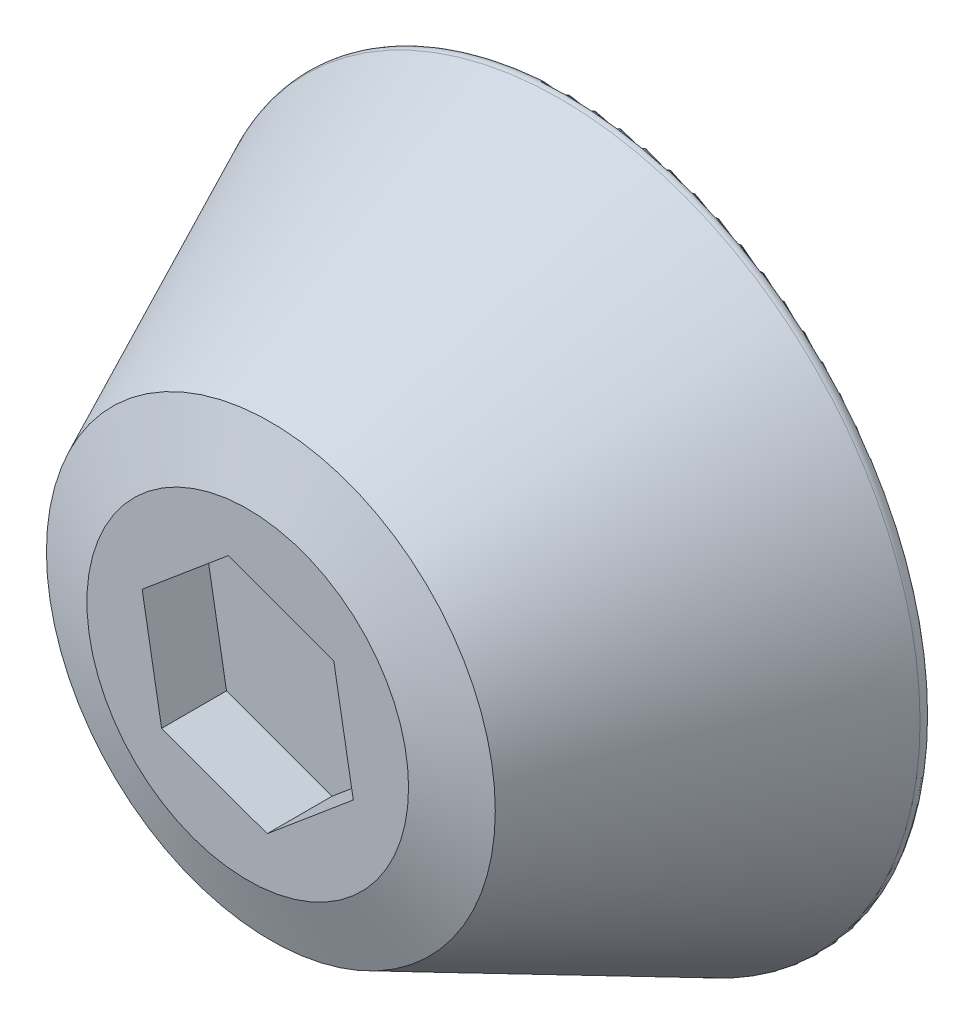
ISO-10303-21;
HEADER;
FILE_DESCRIPTION(('STEP AP214'),'2;1');
FILE_NAME('part.step','',(''),(''),'','','');
FILE_SCHEMA(('AUTOMOTIVE_DESIGN { 1 0 10303 214 1 1 1 1 }'));
ENDSEC;
DATA;
#1=APPLICATION_CONTEXT('core data for automotive mechanical design processes');
#2=APPLICATION_PROTOCOL_DEFINITION('international standard','automotive_design',2000,#1);
#3=PRODUCT_CONTEXT('',#1,'mechanical');
#4=PRODUCT('Part','Part','',(#3));
#5=PRODUCT_RELATED_PRODUCT_CATEGORY('part','',(#4));
#6=PRODUCT_DEFINITION_FORMATION('','',#4);
#7=PRODUCT_DEFINITION_CONTEXT('part definition',#1,'design');
#8=PRODUCT_DEFINITION('design','',#6,#7);
#9=PRODUCT_DEFINITION_SHAPE('','',#8);
#10=(LENGTH_UNIT() NAMED_UNIT(*) SI_UNIT(.MILLI.,.METRE.));
#11=(NAMED_UNIT(*) PLANE_ANGLE_UNIT() SI_UNIT($,.RADIAN.));
#12=(NAMED_UNIT(*) SI_UNIT($,.STERADIAN.) SOLID_ANGLE_UNIT());
#13=UNCERTAINTY_MEASURE_WITH_UNIT(LENGTH_MEASURE(1.E-05),#10,'distance_accuracy_value','');
#14=(GEOMETRIC_REPRESENTATION_CONTEXT(3) GLOBAL_UNCERTAINTY_ASSIGNED_CONTEXT((#13)) GLOBAL_UNIT_ASSIGNED_CONTEXT((#10,
#11,#12)) REPRESENTATION_CONTEXT('',''));
#15=CARTESIAN_POINT('',(0.,0.,0.));
#16=DIRECTION('',(0.,0.,1.));
#17=DIRECTION('',(1.,0.,0.));
#18=AXIS2_PLACEMENT_3D('',#15,#16,#17);
#19=CARTESIAN_POINT('',(0.,0.,0.));
#20=DIRECTION('',(0.,0.,-1.));
#21=DIRECTION('',(1.,0.,0.));
#22=AXIS2_PLACEMENT_3D('',#19,#20,#21);
#23=CONICAL_SURFACE('',#22,28.575,0.436332312998583);
#24=CARTESIAN_POINT('',(0.,0.,0.903362596205347));
#25=DIRECTION('',(0.,0.,1.));
#26=DIRECTION('',(1.,0.,0.));
#27=AXIS2_PLACEMENT_3D('',#24,#25,#26);
#28=CIRCLE('',#27,28.1537551032987);
#29=CARTESIAN_POINT('',(28.1537551032987,0.,0.903362596205347));
#30=VERTEX_POINT('',#29);
#31=EDGE_CURVE('E43',#30,#30,#28,.T.);
#32=ORIENTED_EDGE('',*,*,#31,.T.);
#33=EDGE_LOOP('',(#32));
#34=FACE_BOUND('',#33,.T.);
#35=CARTESIAN_POINT('',(0.,0.,23.5873844259267));
#36=DIRECTION('',(0.,0.,-1.));
#37=DIRECTION('',(-1.,0.,0.));
#38=AXIS2_PLACEMENT_3D('',#35,#36,#37);
#39=CIRCLE('',#38,17.5760220063444);
#40=CARTESIAN_POINT('',(-17.5760220063444,0.,23.5873844259267));
#41=VERTEX_POINT('',#40);
#42=EDGE_CURVE('E178',#41,#41,#39,.T.);
#43=ORIENTED_EDGE('',*,*,#42,.T.);
#44=EDGE_LOOP('',(#43));
#45=FACE_BOUND('',#44,.T.);
#46=ADVANCED_FACE('F35',(#34,#45),#23,.T.);
#47=CARTESIAN_POINT('',(0.,0.,25.4));
#48=DIRECTION('',(0.,0.,1.));
#49=DIRECTION('',(1.,0.,0.));
#50=AXIS2_PLACEMENT_3D('',#47,#48,#49);
#51=PLANE('',#50);
#52=DIRECTION('',(-0.173424497134288,0.984847167734019,0.));
#53=VECTOR('',#52,1.);
#54=CARTESIAN_POINT('',(8.26750072052995,-3.01125087563902,25.4));
#55=LINE('',#54,#53);
#56=CARTESIAN_POINT('',(8.26750072052995,-3.01125087563902,25.4));
#57=VERTEX_POINT('',#56);
#58=CARTESIAN_POINT('',(6.7415701157365,5.65424021196557,25.4));
#59=VERTEX_POINT('',#58);
#60=EDGE_CURVE('E50',#57,#59,#55,.T.);
#61=ORIENTED_EDGE('',*,*,#60,.F.);
#62=DIRECTION('',(0.766190417535671,0.642613604023845,0.));
#63=VECTOR('',#62,1.);
#64=CARTESIAN_POINT('',(1.52593060479344,-8.66549108760459,25.4));
#65=LINE('',#64,#63);
#66=CARTESIAN_POINT('',(1.52593060479344,-8.66549108760459,25.4));
#67=VERTEX_POINT('',#66);
#68=EDGE_CURVE('E128',#67,#57,#65,.T.);
#69=ORIENTED_EDGE('',*,*,#68,.F.);
#70=DIRECTION('',(0.939614914669959,-0.342233563710175,0.));
#71=VECTOR('',#70,1.);
#72=CARTESIAN_POINT('',(-6.7415701157365,-5.65424021196557,25.4));
#73=LINE('',#72,#71);
#74=CARTESIAN_POINT('',(-6.7415701157365,-5.65424021196557,25.4));
#75=VERTEX_POINT('',#74);
#76=EDGE_CURVE('E131',#75,#67,#73,.T.);
#77=ORIENTED_EDGE('',*,*,#76,.F.);
#78=DIRECTION('',(0.173424497134288,-0.984847167734019,0.));
#79=VECTOR('',#78,1.);
#80=CARTESIAN_POINT('',(-8.26750072052995,3.01125087563903,25.4));
#81=LINE('',#80,#79);
#82=CARTESIAN_POINT('',(-8.26750072052995,3.01125087563903,25.4));
#83=VERTEX_POINT('',#82);
#84=EDGE_CURVE('E147',#83,#75,#81,.T.);
#85=ORIENTED_EDGE('',*,*,#84,.F.);
#86=DIRECTION('',(-0.766190417535671,-0.642613604023844,0.));
#87=VECTOR('',#86,1.);
#88=CARTESIAN_POINT('',(-1.52593060479344,8.6654910876046,25.4));
#89=LINE('',#88,#87);
#90=CARTESIAN_POINT('',(-1.52593060479344,8.6654910876046,25.4));
#91=VERTEX_POINT('',#90);
#92=EDGE_CURVE('E144',#91,#83,#89,.T.);
#93=ORIENTED_EDGE('',*,*,#92,.F.);
#94=DIRECTION('',(-0.939614914669959,0.342233563710175,0.));
#95=VECTOR('',#94,1.);
#96=CARTESIAN_POINT('',(6.7415701157365,5.65424021196557,25.4));
#97=LINE('',#96,#95);
#98=EDGE_CURVE('E142',#59,#91,#97,.T.);
#99=ORIENTED_EDGE('',*,*,#98,.F.);
#100=EDGE_LOOP('',(#61,#69,#77,#85,#93,#99));
#101=FACE_BOUND('',#100,.T.);
#102=CARTESIAN_POINT('',(0.,0.,25.4));
#103=DIRECTION('',(0.,0.,1.));
#104=DIRECTION('',(1.,0.,0.));
#105=AXIS2_PLACEMENT_3D('',#102,#103,#104);
#106=CIRCLE('',#105,12.5959016464262);
#107=CARTESIAN_POINT('',(12.5959016464262,0.,25.4));
#108=VERTEX_POINT('',#107);
#109=EDGE_CURVE('E173',#108,#108,#106,.T.);
#110=ORIENTED_EDGE('',*,*,#109,.T.);
#111=EDGE_LOOP('',(#110));
#112=FACE_BOUND('',#111,.T.);
#113=ADVANCED_FACE('F222',(#101,#112),#51,.T.);
#114=CARTESIAN_POINT('',(0.,0.,0.));
#115=DIRECTION('',(0.,0.,1.));
#116=DIRECTION('',(1.,0.,0.));
#117=AXIS2_PLACEMENT_3D('',#114,#115,#116);
#118=PLANE('',#117);
#119=CARTESIAN_POINT('',(0.,0.,0.));
#120=DIRECTION('',(0.,0.,1.));
#121=DIRECTION('',(1.,0.,0.));
#122=AXIS2_PLACEMENT_3D('',#119,#120,#121);
#123=CIRCLE('',#122,27.5782496585304);
#124=CARTESIAN_POINT('',(27.5782496585304,0.,0.));
#125=VERTEX_POINT('',#124);
#126=EDGE_CURVE('E11',#125,#125,#123,.F.);
#127=ORIENTED_EDGE('',*,*,#126,.T.);
#128=EDGE_LOOP('',(#127));
#129=FACE_BOUND('',#128,.T.);
#130=CARTESIAN_POINT('',(0.,0.,0.));
#131=DIRECTION('',(0.,0.,1.));
#132=DIRECTION('',(1.,0.,0.));
#133=AXIS2_PLACEMENT_3D('',#130,#131,#132);
#134=CIRCLE('',#133,5.12500000000005);
#135=CARTESIAN_POINT('',(-2.70982010473022,4.35000000000005,0.));
#136=VERTEX_POINT('',#135);
#137=CARTESIAN_POINT('',(2.70982010473022,4.35000000000005,0.));
#138=VERTEX_POINT('',#137);
#139=EDGE_CURVE('E57',#136,#138,#134,.T.);
#140=ORIENTED_EDGE('',*,*,#139,.T.);
#141=DIRECTION('',(-1.,0.,0.));
#142=VECTOR('',#141,1.);
#143=CARTESIAN_POINT('',(0.,4.35000000000005,0.));
#144=LINE('',#143,#142);
#145=EDGE_CURVE('E185',#138,#136,#144,.T.);
#146=ORIENTED_EDGE('',*,*,#145,.T.);
#147=EDGE_LOOP('',(#140,#146));
#148=FACE_BOUND('',#147,.T.);
#149=ADVANCED_FACE('F228',(#129,#148),#118,.F.);
#150=CARTESIAN_POINT('',(0.,0.,15.25));
#151=DIRECTION('',(0.,0.,-1.));
#152=DIRECTION('',(-1.,0.,0.));
#153=AXIS2_PLACEMENT_3D('',#150,#151,#152);
#154=CYLINDRICAL_SURFACE('',#153,3.125);
#155=DIRECTION('',(0.,0.,-1.));
#156=VECTOR('',#155,1.);
#157=CARTESIAN_POINT('',(2.05988470551145,2.35,15.25));
#158=LINE('',#157,#156);
#159=CARTESIAN_POINT('',(2.05988470551145,2.35,15.25));
#160=VERTEX_POINT('',#159);
#161=CARTESIAN_POINT('',(2.05988470551145,2.35,2.00000000000005));
#162=VERTEX_POINT('',#161);
#163=EDGE_CURVE('E170',#160,#162,#158,.T.);
#164=ORIENTED_EDGE('',*,*,#163,.T.);
#165=CARTESIAN_POINT('',(0.,0.,2.00000000000005));
#166=DIRECTION('',(0.,0.,1.));
#167=DIRECTION('',(1.,0.,0.));
#168=AXIS2_PLACEMENT_3D('',#165,#166,#167);
#169=CIRCLE('',#168,3.125);
#170=CARTESIAN_POINT('',(-2.05988470551145,2.35,2.00000000000005));
#171=VERTEX_POINT('',#170);
#172=EDGE_CURVE('E187',#162,#171,#169,.F.);
#173=ORIENTED_EDGE('',*,*,#172,.T.);
#174=DIRECTION('',(0.,0.,-1.));
#175=VECTOR('',#174,1.);
#176=CARTESIAN_POINT('',(-2.05988470551145,2.35,15.25));
#177=LINE('',#176,#175);
#178=CARTESIAN_POINT('',(-2.05988470551145,2.35,15.25));
#179=VERTEX_POINT('',#178);
#180=EDGE_CURVE('E169',#179,#171,#177,.T.);
#181=ORIENTED_EDGE('',*,*,#180,.F.);
#182=CARTESIAN_POINT('',(0.,0.,15.25));
#183=DIRECTION('',(0.,0.,-1.));
#184=DIRECTION('',(-1.,0.,0.));
#185=AXIS2_PLACEMENT_3D('',#182,#183,#184);
#186=CIRCLE('',#185,3.125);
#187=EDGE_CURVE('E162',#160,#179,#186,.T.);
#188=ORIENTED_EDGE('',*,*,#187,.F.);
#189=EDGE_LOOP('',(#164,#173,#181,#188));
#190=FACE_BOUND('',#189,.T.);
#191=ADVANCED_FACE('F237',(#190),#154,.F.);
#192=CARTESIAN_POINT('',(2.05988470551145,2.35,15.25));
#193=DIRECTION('',(0.,1.,0.));
#194=DIRECTION('',(0.,0.,1.));
#195=AXIS2_PLACEMENT_3D('',#192,#193,#194);
#196=PLANE('',#195);
#197=ORIENTED_EDGE('',*,*,#180,.T.);
#198=DIRECTION('',(1.,0.,0.));
#199=VECTOR('',#198,1.);
#200=CARTESIAN_POINT('',(2.05988470551145,2.35,2.00000000000005));
#201=LINE('',#200,#199);
#202=EDGE_CURVE('E181',#171,#162,#201,.T.);
#203=ORIENTED_EDGE('',*,*,#202,.T.);
#204=ORIENTED_EDGE('',*,*,#163,.F.);
#205=DIRECTION('',(1.,0.,0.));
#206=VECTOR('',#205,1.);
#207=CARTESIAN_POINT('',(2.05988470551145,2.35,15.25));
#208=LINE('',#207,#206);
#209=EDGE_CURVE('E165',#179,#160,#208,.T.);
#210=ORIENTED_EDGE('',*,*,#209,.F.);
#211=EDGE_LOOP('',(#197,#203,#204,#210));
#212=FACE_BOUND('',#211,.T.);
#213=ADVANCED_FACE('F242',(#212),#196,.F.);
#214=CARTESIAN_POINT('',(0.,0.,15.25));
#215=DIRECTION('',(0.,0.,-1.));
#216=DIRECTION('',(-1.,0.,0.));
#217=AXIS2_PLACEMENT_3D('',#214,#215,#216);
#218=PLANE('',#217);
#219=ORIENTED_EDGE('',*,*,#187,.T.);
#220=ORIENTED_EDGE('',*,*,#209,.T.);
#221=EDGE_LOOP('',(#219,#220));
#222=FACE_BOUND('',#221,.T.);
#223=ADVANCED_FACE('F218',(#222),#218,.T.);
#224=CARTESIAN_POINT('',(0.,0.,25.4));
#225=DIRECTION('',(0.,0.,-1.));
#226=DIRECTION('',(-1.,0.,0.));
#227=AXIS2_PLACEMENT_3D('',#224,#225,#226);
#228=CONICAL_SURFACE('',#227,12.5959016464262,1.22173047639603);
#229=ORIENTED_EDGE('',*,*,#42,.F.);
#230=EDGE_LOOP('',(#229));
#231=FACE_BOUND('',#230,.T.);
#232=ORIENTED_EDGE('',*,*,#109,.F.);
#233=EDGE_LOOP('',(#232));
#234=FACE_BOUND('',#233,.T.);
#235=ADVANCED_FACE('F210',(#231,#234),#228,.T.);
#236=CARTESIAN_POINT('',(0.,0.,2.00000000000005));
#237=DIRECTION('',(0.,0.,-1.));
#238=DIRECTION('',(-1.,0.,0.));
#239=AXIS2_PLACEMENT_3D('',#236,#237,#238);
#240=CONICAL_SURFACE('',#239,3.125,0.785398163397449);
#241=CARTESIAN_POINT('',(2.05988470551145,2.35,2.00000000000005));
#242=CARTESIAN_POINT('',(2.12202633636673,2.51533370552846,1.83466629447159));
#243=CARTESIAN_POINT('',(2.1816540066835,2.68112705371499,1.66887294628506));
#244=CARTESIAN_POINT('',(2.29668898737075,3.01340714041361,1.33659285958644));
#245=CARTESIAN_POINT('',(2.35209722987991,3.17989371715903,1.17010628284102));
#246=CARTESIAN_POINT('',(2.45952085277253,3.51338646097843,0.836613539021616));
#247=CARTESIAN_POINT('',(2.5115366663436,3.68039255884892,0.669607441151128));
#248=CARTESIAN_POINT('',(2.61270341318084,4.01487724870323,0.335122751296818));
#249=CARTESIAN_POINT('',(2.66185371371264,4.18235593654481,0.167644063455241));
#250=CARTESIAN_POINT('',(2.70982010473023,4.35000000000005,0.));
#251=B_SPLINE_CURVE_WITH_KNOTS('',3,(#241,#242,#243,#244,#245,#246,#247,#248,#249,#250),
.UNSPECIFIED.,.F.,.F.,(4,2,2,2,4),(0.,0.725762897886165,1.45136499526185,2.17687425657378,
2.90254311563993),.UNSPECIFIED.);
#252=EDGE_CURVE('E154',#138,#162,#251,.F.);
#253=ORIENTED_EDGE('',*,*,#252,.F.);
#254=ORIENTED_EDGE('',*,*,#139,.F.);
#255=CARTESIAN_POINT('',(-2.70982010473022,4.35000000000005,0.));
#256=CARTESIAN_POINT('',(-2.66185371371263,4.18235593654481,0.16764406345524));
#257=CARTESIAN_POINT('',(-2.61270341318084,4.01487724870323,0.335122751296817));
#258=CARTESIAN_POINT('',(-2.5115366663436,3.68039255884892,0.669607441151128));
#259=CARTESIAN_POINT('',(-2.45952085277253,3.51338646097843,0.836613539021615));
#260=CARTESIAN_POINT('',(-2.35209722987991,3.17989371715903,1.17010628284102));
#261=CARTESIAN_POINT('',(-2.29668898737075,3.01340714041361,1.33659285958644));
#262=CARTESIAN_POINT('',(-2.1816540066835,2.68112705371499,1.66887294628506));
#263=CARTESIAN_POINT('',(-2.12202633636673,2.51533370552846,1.83466629447159));
#264=CARTESIAN_POINT('',(-2.05988470551146,2.35,2.00000000000005));
#265=B_SPLINE_CURVE_WITH_KNOTS('',3,(#255,#256,#257,#258,#259,#260,#261,#262,#263,#264),
.UNSPECIFIED.,.F.,.F.,(4,2,2,2,4),(0.,0.725668859066152,1.45117812037808,2.17678021775377,
2.90254311563993),.UNSPECIFIED.);
#266=EDGE_CURVE('E166',#171,#136,#265,.F.);
#267=ORIENTED_EDGE('',*,*,#266,.F.);
#268=ORIENTED_EDGE('',*,*,#172,.F.);
#269=EDGE_LOOP('',(#253,#254,#267,#268));
#270=FACE_BOUND('',#269,.T.);
#271=ADVANCED_FACE('F204',(#270),#240,.F.);
#272=CARTESIAN_POINT('',(2.05988470551145,2.35,2.00000000000005));
#273=DIRECTION('',(0.,0.707106781186547,0.707106781186548));
#274=DIRECTION('',(1.,0.,0.));
#275=AXIS2_PLACEMENT_3D('',#272,#273,#274);
#276=PLANE('',#275);
#277=ORIENTED_EDGE('',*,*,#266,.T.);
#278=ORIENTED_EDGE('',*,*,#145,.F.);
#279=ORIENTED_EDGE('',*,*,#252,.T.);
#280=ORIENTED_EDGE('',*,*,#202,.F.);
#281=EDGE_LOOP('',(#277,#278,#279,#280));
#282=FACE_BOUND('',#281,.T.);
#283=ADVANCED_FACE('F200',(#282),#276,.F.);
#284=CARTESIAN_POINT('',(8.26750072052995,-3.01125087563902,20.32));
#285=DIRECTION('',(0.984847167734019,0.173424497134288,0.));
#286=DIRECTION('',(-0.173424497134288,0.984847167734019,0.));
#287=AXIS2_PLACEMENT_3D('',#284,#285,#286);
#288=PLANE('',#287);
#289=ORIENTED_EDGE('',*,*,#60,.T.);
#290=DIRECTION('',(0.,0.,1.));
#291=VECTOR('',#290,1.);
#292=CARTESIAN_POINT('',(6.7415701157365,5.65424021196557,20.32));
#293=LINE('',#292,#291);
#294=CARTESIAN_POINT('',(6.7415701157365,5.65424021196557,20.32));
#295=VERTEX_POINT('',#294);
#296=EDGE_CURVE('E105',#295,#59,#293,.T.);
#297=ORIENTED_EDGE('',*,*,#296,.F.);
#298=DIRECTION('',(-0.173424497134288,0.984847167734019,0.));
#299=VECTOR('',#298,1.);
#300=CARTESIAN_POINT('',(8.26750072052995,-3.01125087563902,20.32));
#301=LINE('',#300,#299);
#302=CARTESIAN_POINT('',(8.26750072052995,-3.01125087563902,20.32));
#303=VERTEX_POINT('',#302);
#304=EDGE_CURVE('E109',#303,#295,#301,.T.);
#305=ORIENTED_EDGE('',*,*,#304,.F.);
#306=DIRECTION('',(0.,0.,1.));
#307=VECTOR('',#306,1.);
#308=CARTESIAN_POINT('',(8.26750072052995,-3.01125087563902,20.32));
#309=LINE('',#308,#307);
#310=EDGE_CURVE('E152',#303,#57,#309,.T.);
#311=ORIENTED_EDGE('',*,*,#310,.T.);
#312=EDGE_LOOP('',(#289,#297,#305,#311));
#313=FACE_BOUND('',#312,.T.);
#314=ADVANCED_FACE('F107',(#313),#288,.F.);
#315=CARTESIAN_POINT('',(1.52593060479344,-8.66549108760459,20.32));
#316=DIRECTION('',(0.642613604023844,-0.766190417535671,0.));
#317=DIRECTION('',(0.766190417535671,0.642613604023845,0.));
#318=AXIS2_PLACEMENT_3D('',#315,#316,#317);
#319=PLANE('',#318);
#320=ORIENTED_EDGE('',*,*,#68,.T.);
#321=ORIENTED_EDGE('',*,*,#310,.F.);
#322=DIRECTION('',(0.766190417535671,0.642613604023845,0.));
#323=VECTOR('',#322,1.);
#324=CARTESIAN_POINT('',(1.52593060479344,-8.66549108760459,20.32));
#325=LINE('',#324,#323);
#326=CARTESIAN_POINT('',(1.52593060479344,-8.66549108760459,20.32));
#327=VERTEX_POINT('',#326);
#328=EDGE_CURVE('E115',#327,#303,#325,.T.);
#329=ORIENTED_EDGE('',*,*,#328,.F.);
#330=DIRECTION('',(0.,0.,1.));
#331=VECTOR('',#330,1.);
#332=CARTESIAN_POINT('',(1.52593060479344,-8.66549108760459,20.32));
#333=LINE('',#332,#331);
#334=EDGE_CURVE('E155',#327,#67,#333,.T.);
#335=ORIENTED_EDGE('',*,*,#334,.T.);
#336=EDGE_LOOP('',(#320,#321,#329,#335));
#337=FACE_BOUND('',#336,.T.);
#338=ADVANCED_FACE('F252',(#337),#319,.F.);
#339=CARTESIAN_POINT('',(-6.7415701157365,-5.65424021196557,20.32));
#340=DIRECTION('',(-0.342233563710175,-0.939614914669959,0.));
#341=DIRECTION('',(0.939614914669959,-0.342233563710175,0.));
#342=AXIS2_PLACEMENT_3D('',#339,#340,#341);
#343=PLANE('',#342);
#344=ORIENTED_EDGE('',*,*,#76,.T.);
#345=ORIENTED_EDGE('',*,*,#334,.F.);
#346=DIRECTION('',(0.939614914669959,-0.342233563710175,0.));
#347=VECTOR('',#346,1.);
#348=CARTESIAN_POINT('',(-6.7415701157365,-5.65424021196557,20.32));
#349=LINE('',#348,#347);
#350=CARTESIAN_POINT('',(-6.7415701157365,-5.65424021196557,20.32));
#351=VERTEX_POINT('',#350);
#352=EDGE_CURVE('E138',#351,#327,#349,.T.);
#353=ORIENTED_EDGE('',*,*,#352,.F.);
#354=DIRECTION('',(0.,0.,1.));
#355=VECTOR('',#354,1.);
#356=CARTESIAN_POINT('',(-6.7415701157365,-5.65424021196557,20.32));
#357=LINE('',#356,#355);
#358=EDGE_CURVE('E157',#351,#75,#357,.T.);
#359=ORIENTED_EDGE('',*,*,#358,.T.);
#360=EDGE_LOOP('',(#344,#345,#353,#359));
#361=FACE_BOUND('',#360,.T.);
#362=ADVANCED_FACE('F262',(#361),#343,.F.);
#363=CARTESIAN_POINT('',(-8.26750072052995,3.01125087563903,20.32));
#364=DIRECTION('',(-0.984847167734019,-0.173424497134288,0.));
#365=DIRECTION('',(0.173424497134288,-0.984847167734019,0.));
#366=AXIS2_PLACEMENT_3D('',#363,#364,#365);
#367=PLANE('',#366);
#368=ORIENTED_EDGE('',*,*,#84,.T.);
#369=ORIENTED_EDGE('',*,*,#358,.F.);
#370=DIRECTION('',(0.173424497134288,-0.984847167734019,0.));
#371=VECTOR('',#370,1.);
#372=CARTESIAN_POINT('',(-8.26750072052995,3.01125087563903,20.32));
#373=LINE('',#372,#371);
#374=CARTESIAN_POINT('',(-8.26750072052995,3.01125087563903,20.32));
#375=VERTEX_POINT('',#374);
#376=EDGE_CURVE('E135',#375,#351,#373,.T.);
#377=ORIENTED_EDGE('',*,*,#376,.F.);
#378=DIRECTION('',(0.,0.,1.));
#379=VECTOR('',#378,1.);
#380=CARTESIAN_POINT('',(-8.26750072052995,3.01125087563903,20.32));
#381=LINE('',#380,#379);
#382=EDGE_CURVE('E159',#375,#83,#381,.T.);
#383=ORIENTED_EDGE('',*,*,#382,.T.);
#384=EDGE_LOOP('',(#368,#369,#377,#383));
#385=FACE_BOUND('',#384,.T.);
#386=ADVANCED_FACE('F258',(#385),#367,.F.);
#387=CARTESIAN_POINT('',(-1.52593060479344,8.6654910876046,20.32));
#388=DIRECTION('',(-0.642613604023844,0.766190417535671,0.));
#389=DIRECTION('',(-0.766190417535671,-0.642613604023844,0.));
#390=AXIS2_PLACEMENT_3D('',#387,#388,#389);
#391=PLANE('',#390);
#392=ORIENTED_EDGE('',*,*,#92,.T.);
#393=ORIENTED_EDGE('',*,*,#382,.F.);
#394=DIRECTION('',(-0.766190417535671,-0.642613604023844,0.));
#395=VECTOR('',#394,1.);
#396=CARTESIAN_POINT('',(-1.52593060479344,8.6654910876046,20.32));
#397=LINE('',#396,#395);
#398=CARTESIAN_POINT('',(-1.52593060479344,8.6654910876046,20.32));
#399=VERTEX_POINT('',#398);
#400=EDGE_CURVE('E123',#399,#375,#397,.T.);
#401=ORIENTED_EDGE('',*,*,#400,.F.);
#402=DIRECTION('',(0.,0.,1.));
#403=VECTOR('',#402,1.);
#404=CARTESIAN_POINT('',(-1.52593060479344,8.6654910876046,20.32));
#405=LINE('',#404,#403);
#406=EDGE_CURVE('E114',#399,#91,#405,.T.);
#407=ORIENTED_EDGE('',*,*,#406,.T.);
#408=EDGE_LOOP('',(#392,#393,#401,#407));
#409=FACE_BOUND('',#408,.T.);
#410=ADVANCED_FACE('F255',(#409),#391,.F.);
#411=CARTESIAN_POINT('',(6.7415701157365,5.65424021196557,20.32));
#412=DIRECTION('',(0.342233563710175,0.939614914669959,0.));
#413=DIRECTION('',(-0.939614914669959,0.342233563710175,0.));
#414=AXIS2_PLACEMENT_3D('',#411,#412,#413);
#415=PLANE('',#414);
#416=ORIENTED_EDGE('',*,*,#98,.T.);
#417=ORIENTED_EDGE('',*,*,#406,.F.);
#418=DIRECTION('',(-0.939614914669959,0.342233563710175,0.));
#419=VECTOR('',#418,1.);
#420=CARTESIAN_POINT('',(6.7415701157365,5.65424021196557,20.32));
#421=LINE('',#420,#419);
#422=EDGE_CURVE('E118',#295,#399,#421,.T.);
#423=ORIENTED_EDGE('',*,*,#422,.F.);
#424=ORIENTED_EDGE('',*,*,#296,.T.);
#425=EDGE_LOOP('',(#416,#417,#423,#424));
#426=FACE_BOUND('',#425,.T.);
#427=ADVANCED_FACE('F119',(#426),#415,.F.);
#428=CARTESIAN_POINT('',(0.,0.,20.32));
#429=DIRECTION('',(0.,0.,1.));
#430=DIRECTION('',(1.,0.,0.));
#431=AXIS2_PLACEMENT_3D('',#428,#429,#430);
#432=PLANE('',#431);
#433=ORIENTED_EDGE('',*,*,#304,.T.);
#434=ORIENTED_EDGE('',*,*,#422,.T.);
#435=ORIENTED_EDGE('',*,*,#400,.T.);
#436=ORIENTED_EDGE('',*,*,#376,.T.);
#437=ORIENTED_EDGE('',*,*,#352,.T.);
#438=ORIENTED_EDGE('',*,*,#328,.T.);
#439=EDGE_LOOP('',(#433,#434,#435,#436,#437,#438));
#440=FACE_BOUND('',#439,.T.);
#441=ADVANCED_FACE('F125',(#440),#432,.T.);
#442=CARTESIAN_POINT('',(0.,0.,0.635));
#443=DIRECTION('',(0.,0.,1.));
#444=DIRECTION('',(1.,0.,0.));
#445=AXIS2_PLACEMENT_3D('',#442,#443,#444);
#446=TOROIDAL_SURFACE('',#445,27.5782496585304,0.635);
#447=ORIENTED_EDGE('',*,*,#126,.F.);
#448=EDGE_LOOP('',(#447));
#449=FACE_BOUND('',#448,.T.);
#450=ORIENTED_EDGE('',*,*,#31,.F.);
#451=EDGE_LOOP('',(#450));
#452=FACE_BOUND('',#451,.T.);
#453=ADVANCED_FACE('F37',(#449,#452),#446,.T.);
#454=CLOSED_SHELL('',(#46,#113,#149,#191,#213,#223,#235,#271,#283,#314,#338,#362,#386,#410,#427,
#441,#453));
#455=MANIFOLD_SOLID_BREP('B2',#454);
#456=ADVANCED_BREP_SHAPE_REPRESENTATION('',(#18,#455),#14);
#457=SHAPE_DEFINITION_REPRESENTATION(#9,#456);
ENDSEC;
END-ISO-10303-21;
